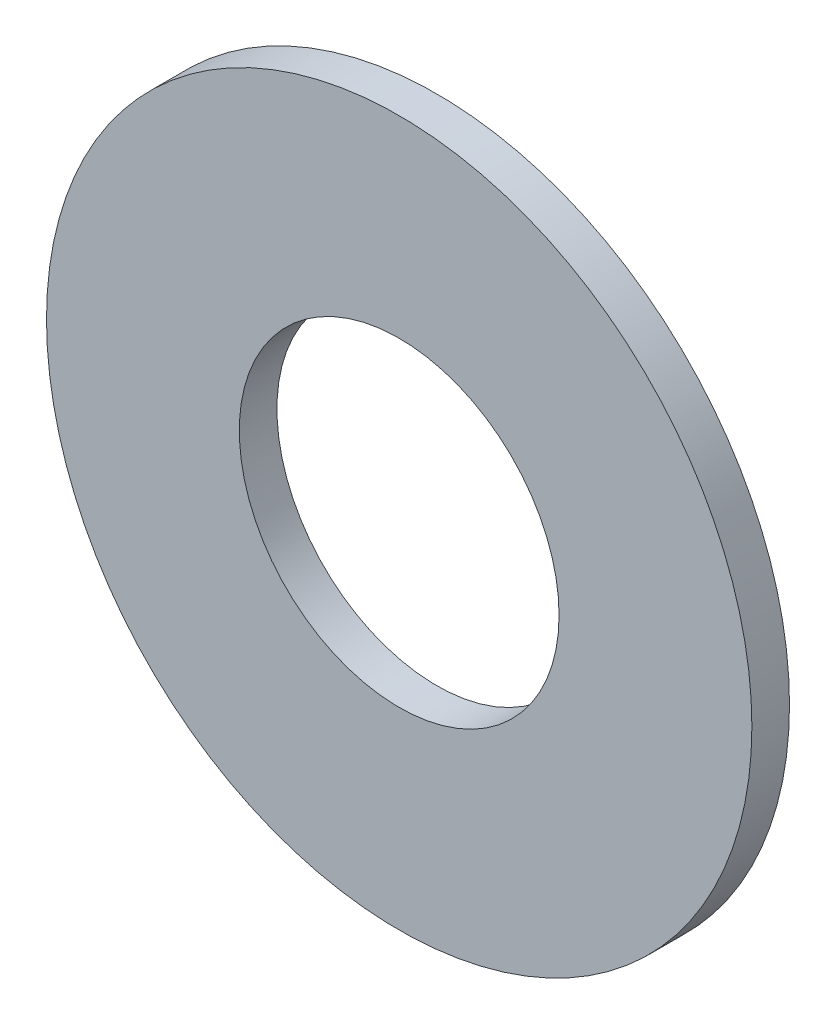
ISO-10303-21;
HEADER;
FILE_DESCRIPTION(('STEP AP214'),'2;1');
FILE_NAME('part.step','',(''),(''),'','','');
FILE_SCHEMA(('AUTOMOTIVE_DESIGN { 1 0 10303 214 1 1 1 1 }'));
ENDSEC;
DATA;
#1=APPLICATION_CONTEXT('core data for automotive mechanical design processes');
#2=APPLICATION_PROTOCOL_DEFINITION('international standard','automotive_design',2000,#1);
#3=PRODUCT_CONTEXT('',#1,'mechanical');
#4=PRODUCT('Part','Part','',(#3));
#5=PRODUCT_RELATED_PRODUCT_CATEGORY('part','',(#4));
#6=PRODUCT_DEFINITION_FORMATION('','',#4);
#7=PRODUCT_DEFINITION_CONTEXT('part definition',#1,'design');
#8=PRODUCT_DEFINITION('design','',#6,#7);
#9=PRODUCT_DEFINITION_SHAPE('','',#8);
#10=(LENGTH_UNIT() NAMED_UNIT(*) SI_UNIT(.MILLI.,.METRE.));
#11=(NAMED_UNIT(*) PLANE_ANGLE_UNIT() SI_UNIT($,.RADIAN.));
#12=(NAMED_UNIT(*) SI_UNIT($,.STERADIAN.) SOLID_ANGLE_UNIT());
#13=UNCERTAINTY_MEASURE_WITH_UNIT(LENGTH_MEASURE(1.E-05),#10,'distance_accuracy_value','');
#14=(GEOMETRIC_REPRESENTATION_CONTEXT(3) GLOBAL_UNCERTAINTY_ASSIGNED_CONTEXT((#13)) GLOBAL_UNIT_ASSIGNED_CONTEXT((#10,
#11,#12)) REPRESENTATION_CONTEXT('',''));
#15=CARTESIAN_POINT('',(0.,0.,0.));
#16=DIRECTION('',(0.,0.,1.));
#17=DIRECTION('',(1.,0.,0.));
#18=AXIS2_PLACEMENT_3D('',#15,#16,#17);
#19=CARTESIAN_POINT('',(0.,0.,-0.508));
#20=DIRECTION('',(0.,0.,1.));
#21=DIRECTION('',(1.,0.,0.));
#22=AXIS2_PLACEMENT_3D('',#19,#20,#21);
#23=CYLINDRICAL_SURFACE('',#22,4.7625);
#24=CARTESIAN_POINT('',(0.,0.,-0.508));
#25=DIRECTION('',(0.,0.,1.));
#26=DIRECTION('',(1.,0.,0.));
#27=AXIS2_PLACEMENT_3D('',#24,#25,#26);
#28=CIRCLE('',#27,4.7625);
#29=CARTESIAN_POINT('',(4.7625,0.,-0.508));
#30=VERTEX_POINT('',#29);
#31=EDGE_CURVE('E10',#30,#30,#28,.T.);
#32=ORIENTED_EDGE('',*,*,#31,.T.);
#33=EDGE_LOOP('',(#32));
#34=FACE_BOUND('',#33,.T.);
#35=CARTESIAN_POINT('',(0.,0.,0.));
#36=DIRECTION('',(0.,0.,1.));
#37=DIRECTION('',(1.,0.,0.));
#38=AXIS2_PLACEMENT_3D('',#35,#36,#37);
#39=CIRCLE('',#38,4.7625);
#40=CARTESIAN_POINT('',(4.7625,0.,0.));
#41=VERTEX_POINT('',#40);
#42=EDGE_CURVE('E33',#41,#41,#39,.T.);
#43=ORIENTED_EDGE('',*,*,#42,.F.);
#44=EDGE_LOOP('',(#43));
#45=FACE_BOUND('',#44,.T.);
#46=ADVANCED_FACE('F30',(#34,#45),#23,.T.);
#47=CARTESIAN_POINT('',(0.,0.,-0.508));
#48=DIRECTION('',(0.,0.,1.));
#49=DIRECTION('',(1.,0.,0.));
#50=AXIS2_PLACEMENT_3D('',#47,#48,#49);
#51=PLANE('',#50);
#52=CARTESIAN_POINT('',(0.,0.,-0.508));
#53=DIRECTION('',(0.,0.,1.));
#54=DIRECTION('',(1.,0.,0.));
#55=AXIS2_PLACEMENT_3D('',#52,#53,#54);
#56=CIRCLE('',#55,2.159);
#57=CARTESIAN_POINT('',(2.159,0.,-0.508));
#58=VERTEX_POINT('',#57);
#59=EDGE_CURVE('E40',#58,#58,#56,.T.);
#60=ORIENTED_EDGE('',*,*,#59,.T.);
#61=EDGE_LOOP('',(#60));
#62=FACE_BOUND('',#61,.T.);
#63=ORIENTED_EDGE('',*,*,#31,.F.);
#64=EDGE_LOOP('',(#63));
#65=FACE_BOUND('',#64,.T.);
#66=ADVANCED_FACE('F48',(#62,#65),#51,.F.);
#67=CARTESIAN_POINT('',(0.,0.,0.));
#68=DIRECTION('',(0.,0.,1.));
#69=DIRECTION('',(1.,0.,0.));
#70=AXIS2_PLACEMENT_3D('',#67,#68,#69);
#71=PLANE('',#70);
#72=CARTESIAN_POINT('',(0.,0.,0.));
#73=DIRECTION('',(0.,0.,1.));
#74=DIRECTION('',(1.,0.,0.));
#75=AXIS2_PLACEMENT_3D('',#72,#73,#74);
#76=CIRCLE('',#75,2.159);
#77=CARTESIAN_POINT('',(2.159,0.,0.));
#78=VERTEX_POINT('',#77);
#79=EDGE_CURVE('E42',#78,#78,#76,.T.);
#80=ORIENTED_EDGE('',*,*,#79,.F.);
#81=EDGE_LOOP('',(#80));
#82=FACE_BOUND('',#81,.T.);
#83=ORIENTED_EDGE('',*,*,#42,.T.);
#84=EDGE_LOOP('',(#83));
#85=FACE_BOUND('',#84,.T.);
#86=ADVANCED_FACE('F54',(#82,#85),#71,.T.);
#87=CARTESIAN_POINT('',(0.,0.,-0.508));
#88=DIRECTION('',(0.,0.,1.));
#89=DIRECTION('',(1.,0.,0.));
#90=AXIS2_PLACEMENT_3D('',#87,#88,#89);
#91=CYLINDRICAL_SURFACE('',#90,2.159);
#92=ORIENTED_EDGE('',*,*,#59,.F.);
#93=EDGE_LOOP('',(#92));
#94=FACE_BOUND('',#93,.T.);
#95=ORIENTED_EDGE('',*,*,#79,.T.);
#96=EDGE_LOOP('',(#95));
#97=FACE_BOUND('',#96,.T.);
#98=ADVANCED_FACE('F51',(#94,#97),#91,.F.);
#99=CLOSED_SHELL('',(#46,#66,#86,#98));
#100=MANIFOLD_SOLID_BREP('B2',#99);
#101=ADVANCED_BREP_SHAPE_REPRESENTATION('',(#18,#100),#14);
#102=SHAPE_DEFINITION_REPRESENTATION(#9,#101);
ENDSEC;
END-ISO-10303-21;
